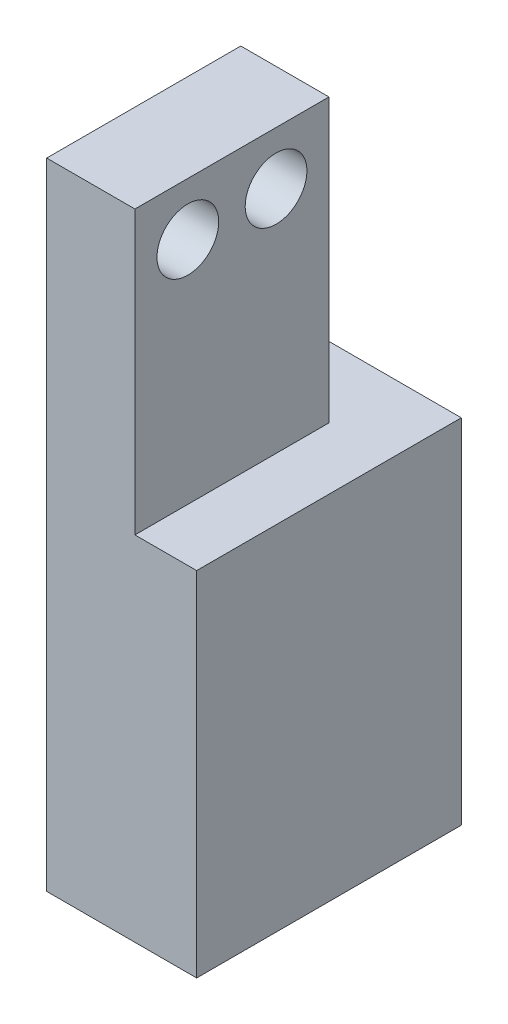
ISO-10303-21;
HEADER;
FILE_DESCRIPTION(('STEP AP214'),'2;1');
FILE_NAME('part.step','',(''),(''),'','','');
FILE_SCHEMA(('AUTOMOTIVE_DESIGN { 1 0 10303 214 1 1 1 1 }'));
ENDSEC;
DATA;
#1=APPLICATION_CONTEXT('core data for automotive mechanical design processes');
#2=APPLICATION_PROTOCOL_DEFINITION('international standard','automotive_design',2000,#1);
#3=PRODUCT_CONTEXT('',#1,'mechanical');
#4=PRODUCT('Part','Part','',(#3));
#5=PRODUCT_RELATED_PRODUCT_CATEGORY('part','',(#4));
#6=PRODUCT_DEFINITION_FORMATION('','',#4);
#7=PRODUCT_DEFINITION_CONTEXT('part definition',#1,'design');
#8=PRODUCT_DEFINITION('design','',#6,#7);
#9=PRODUCT_DEFINITION_SHAPE('','',#8);
#10=(LENGTH_UNIT() NAMED_UNIT(*) SI_UNIT(.MILLI.,.METRE.));
#11=(NAMED_UNIT(*) PLANE_ANGLE_UNIT() SI_UNIT($,.RADIAN.));
#12=(NAMED_UNIT(*) SI_UNIT($,.STERADIAN.) SOLID_ANGLE_UNIT());
#13=UNCERTAINTY_MEASURE_WITH_UNIT(LENGTH_MEASURE(1.E-05),#10,'distance_accuracy_value','');
#14=(GEOMETRIC_REPRESENTATION_CONTEXT(3) GLOBAL_UNCERTAINTY_ASSIGNED_CONTEXT((#13)) GLOBAL_UNIT_ASSIGNED_CONTEXT((#10,
#11,#12)) REPRESENTATION_CONTEXT('',''));
#15=CARTESIAN_POINT('',(0.,0.,0.));
#16=DIRECTION('',(0.,0.,1.));
#17=DIRECTION('',(1.,0.,0.));
#18=AXIS2_PLACEMENT_3D('',#15,#16,#17);
#19=CARTESIAN_POINT('',(0.,0.,-15.));
#20=DIRECTION('',(0.,0.,1.));
#21=DIRECTION('',(1.,0.,0.));
#22=AXIS2_PLACEMENT_3D('',#19,#20,#21);
#23=PLANE('',#22);
#24=DIRECTION('',(0.,-1.,0.));
#25=VECTOR('',#24,1.);
#26=CARTESIAN_POINT('',(0.,36.,-15.));
#27=LINE('',#26,#25);
#28=CARTESIAN_POINT('',(0.,20.,-15.));
#29=VERTEX_POINT('',#28);
#30=CARTESIAN_POINT('',(0.,0.,-15.));
#31=VERTEX_POINT('',#30);
#32=EDGE_CURVE('E86',#29,#31,#27,.T.);
#33=ORIENTED_EDGE('',*,*,#32,.F.);
#34=DIRECTION('',(-1.,0.,0.));
#35=VECTOR('',#34,1.);
#36=CARTESIAN_POINT('',(8.5,20.,-15.));
#37=LINE('',#36,#35);
#38=CARTESIAN_POINT('',(8.5,20.,-15.));
#39=VERTEX_POINT('',#38);
#40=EDGE_CURVE('E121',#39,#29,#37,.T.);
#41=ORIENTED_EDGE('',*,*,#40,.F.);
#42=DIRECTION('',(0.,1.,0.));
#43=VECTOR('',#42,1.);
#44=CARTESIAN_POINT('',(8.5,0.,-15.));
#45=LINE('',#44,#43);
#46=CARTESIAN_POINT('',(8.5,0.,-15.));
#47=VERTEX_POINT('',#46);
#48=EDGE_CURVE('E123',#47,#39,#45,.T.);
#49=ORIENTED_EDGE('',*,*,#48,.F.);
#50=DIRECTION('',(1.,0.,0.));
#51=VECTOR('',#50,1.);
#52=CARTESIAN_POINT('',(0.,0.,-15.));
#53=LINE('',#52,#51);
#54=EDGE_CURVE('E126',#31,#47,#53,.T.);
#55=ORIENTED_EDGE('',*,*,#54,.F.);
#56=EDGE_LOOP('',(#33,#41,#49,#55));
#57=FACE_BOUND('',#56,.T.);
#58=ADVANCED_FACE('F35',(#57),#23,.F.);
#59=CARTESIAN_POINT('',(5.,36.,-15.));
#60=DIRECTION('',(0.,1.,0.));
#61=DIRECTION('',(0.,0.,1.));
#62=AXIS2_PLACEMENT_3D('',#59,#60,#61);
#63=PLANE('',#62);
#64=DIRECTION('',(1.,0.,0.));
#65=VECTOR('',#64,1.);
#66=CARTESIAN_POINT('',(0.,36.,-11.));
#67=LINE('',#66,#65);
#68=CARTESIAN_POINT('',(0.,36.,-11.));
#69=VERTEX_POINT('',#68);
#70=CARTESIAN_POINT('',(5.,36.,-11.));
#71=VERTEX_POINT('',#70);
#72=EDGE_CURVE('E106',#69,#71,#67,.T.);
#73=ORIENTED_EDGE('',*,*,#72,.F.);
#74=DIRECTION('',(0.,0.,1.));
#75=VECTOR('',#74,1.);
#76=CARTESIAN_POINT('',(0.,36.,-15.));
#77=LINE('',#76,#75);
#78=CARTESIAN_POINT('',(0.,36.,0.));
#79=VERTEX_POINT('',#78);
#80=EDGE_CURVE('E39',#69,#79,#77,.T.);
#81=ORIENTED_EDGE('',*,*,#80,.T.);
#82=DIRECTION('',(-1.,0.,0.));
#83=VECTOR('',#82,1.);
#84=CARTESIAN_POINT('',(5.,36.,0.));
#85=LINE('',#84,#83);
#86=CARTESIAN_POINT('',(5.,36.,0.));
#87=VERTEX_POINT('',#86);
#88=EDGE_CURVE('E130',#87,#79,#85,.T.);
#89=ORIENTED_EDGE('',*,*,#88,.F.);
#90=DIRECTION('',(0.,0.,1.));
#91=VECTOR('',#90,1.);
#92=CARTESIAN_POINT('',(5.,36.,-15.));
#93=LINE('',#92,#91);
#94=EDGE_CURVE('E11',#71,#87,#93,.T.);
#95=ORIENTED_EDGE('',*,*,#94,.F.);
#96=EDGE_LOOP('',(#73,#81,#89,#95));
#97=FACE_BOUND('',#96,.T.);
#98=ADVANCED_FACE('F37',(#97),#63,.T.);
#99=CARTESIAN_POINT('',(5.,20.,-15.));
#100=DIRECTION('',(1.,0.,0.));
#101=DIRECTION('',(0.,1.,0.));
#102=AXIS2_PLACEMENT_3D('',#99,#100,#101);
#103=PLANE('',#102);
#104=CARTESIAN_POINT('',(5.,33.,-3.));
#105=DIRECTION('',(1.,0.,0.));
#106=DIRECTION('',(0.,1.,0.));
#107=AXIS2_PLACEMENT_3D('',#104,#105,#106);
#108=CIRCLE('',#107,1.75);
#109=CARTESIAN_POINT('',(5.,34.75,-3.));
#110=VERTEX_POINT('',#109);
#111=EDGE_CURVE('E170',#110,#110,#108,.T.);
#112=ORIENTED_EDGE('',*,*,#111,.F.);
#113=EDGE_LOOP('',(#112));
#114=FACE_BOUND('',#113,.T.);
#115=CARTESIAN_POINT('',(5.,33.,-8.));
#116=DIRECTION('',(1.,0.,0.));
#117=DIRECTION('',(0.,1.,0.));
#118=AXIS2_PLACEMENT_3D('',#115,#116,#117);
#119=CIRCLE('',#118,1.75);
#120=CARTESIAN_POINT('',(5.,34.75,-8.));
#121=VERTEX_POINT('',#120);
#122=EDGE_CURVE('E164',#121,#121,#119,.T.);
#123=ORIENTED_EDGE('',*,*,#122,.F.);
#124=EDGE_LOOP('',(#123));
#125=FACE_BOUND('',#124,.T.);
#126=DIRECTION('',(0.,1.,0.));
#127=VECTOR('',#126,1.);
#128=CARTESIAN_POINT('',(5.,13.5968757625671,-11.));
#129=LINE('',#128,#127);
#130=CARTESIAN_POINT('',(5.,20.,-11.));
#131=VERTEX_POINT('',#130);
#132=EDGE_CURVE('E110',#131,#71,#129,.T.);
#133=ORIENTED_EDGE('',*,*,#132,.T.);
#134=ORIENTED_EDGE('',*,*,#94,.T.);
#135=DIRECTION('',(0.,1.,0.));
#136=VECTOR('',#135,1.);
#137=CARTESIAN_POINT('',(5.,20.,0.));
#138=LINE('',#137,#136);
#139=CARTESIAN_POINT('',(5.,20.,0.));
#140=VERTEX_POINT('',#139);
#141=EDGE_CURVE('E141',#140,#87,#138,.T.);
#142=ORIENTED_EDGE('',*,*,#141,.F.);
#143=DIRECTION('',(0.,0.,1.));
#144=VECTOR('',#143,1.);
#145=CARTESIAN_POINT('',(5.,20.,-15.));
#146=LINE('',#145,#144);
#147=EDGE_CURVE('E45',#131,#140,#146,.T.);
#148=ORIENTED_EDGE('',*,*,#147,.F.);
#149=EDGE_LOOP('',(#133,#134,#142,#148));
#150=FACE_BOUND('',#149,.T.);
#151=ADVANCED_FACE('F157',(#114,#125,#150),#103,.T.);
#152=CARTESIAN_POINT('',(8.5,20.,-15.));
#153=DIRECTION('',(0.,1.,0.));
#154=DIRECTION('',(0.,0.,1.));
#155=AXIS2_PLACEMENT_3D('',#152,#153,#154);
#156=PLANE('',#155);
#157=DIRECTION('',(-1.,0.,0.));
#158=VECTOR('',#157,1.);
#159=CARTESIAN_POINT('',(8.5,20.,0.));
#160=LINE('',#159,#158);
#161=CARTESIAN_POINT('',(8.5,20.,0.));
#162=VERTEX_POINT('',#161);
#163=EDGE_CURVE('E139',#162,#140,#160,.T.);
#164=ORIENTED_EDGE('',*,*,#163,.F.);
#165=DIRECTION('',(0.,0.,1.));
#166=VECTOR('',#165,1.);
#167=CARTESIAN_POINT('',(8.5,20.,-15.));
#168=LINE('',#167,#166);
#169=EDGE_CURVE('E54',#39,#162,#168,.T.);
#170=ORIENTED_EDGE('',*,*,#169,.F.);
#171=ORIENTED_EDGE('',*,*,#40,.T.);
#172=DIRECTION('',(0.,0.,-1.));
#173=VECTOR('',#172,1.);
#174=CARTESIAN_POINT('',(0.,20.,-15.));
#175=LINE('',#174,#173);
#176=CARTESIAN_POINT('',(0.,20.,-11.));
#177=VERTEX_POINT('',#176);
#178=EDGE_CURVE('E158',#177,#29,#175,.T.);
#179=ORIENTED_EDGE('',*,*,#178,.F.);
#180=DIRECTION('',(-1.,0.,0.));
#181=VECTOR('',#180,1.);
#182=CARTESIAN_POINT('',(0.,20.,-11.));
#183=LINE('',#182,#181);
#184=EDGE_CURVE('E107',#131,#177,#183,.T.);
#185=ORIENTED_EDGE('',*,*,#184,.F.);
#186=ORIENTED_EDGE('',*,*,#147,.T.);
#187=EDGE_LOOP('',(#164,#170,#171,#179,#185,#186));
#188=FACE_BOUND('',#187,.T.);
#189=ADVANCED_FACE('F187',(#188),#156,.T.);
#190=CARTESIAN_POINT('',(8.5,0.,-15.));
#191=DIRECTION('',(1.,0.,0.));
#192=DIRECTION('',(0.,0.,-1.));
#193=AXIS2_PLACEMENT_3D('',#190,#191,#192);
#194=PLANE('',#193);
#195=DIRECTION('',(0.,1.,0.));
#196=VECTOR('',#195,1.);
#197=CARTESIAN_POINT('',(8.5,0.,0.));
#198=LINE('',#197,#196);
#199=CARTESIAN_POINT('',(8.5,0.,0.));
#200=VERTEX_POINT('',#199);
#201=EDGE_CURVE('E136',#200,#162,#198,.T.);
#202=ORIENTED_EDGE('',*,*,#201,.F.);
#203=DIRECTION('',(0.,0.,1.));
#204=VECTOR('',#203,1.);
#205=CARTESIAN_POINT('',(8.5,0.,-15.));
#206=LINE('',#205,#204);
#207=EDGE_CURVE('E122',#47,#200,#206,.T.);
#208=ORIENTED_EDGE('',*,*,#207,.F.);
#209=ORIENTED_EDGE('',*,*,#48,.T.);
#210=ORIENTED_EDGE('',*,*,#169,.T.);
#211=EDGE_LOOP('',(#202,#208,#209,#210));
#212=FACE_BOUND('',#211,.T.);
#213=ADVANCED_FACE('F154',(#212),#194,.T.);
#214=CARTESIAN_POINT('',(0.,0.,-15.));
#215=DIRECTION('',(0.,-1.,0.));
#216=DIRECTION('',(0.,0.,-1.));
#217=AXIS2_PLACEMENT_3D('',#214,#215,#216);
#218=PLANE('',#217);
#219=DIRECTION('',(1.,0.,0.));
#220=VECTOR('',#219,1.);
#221=CARTESIAN_POINT('',(0.,0.,0.));
#222=LINE('',#221,#220);
#223=CARTESIAN_POINT('',(0.,0.,0.));
#224=VERTEX_POINT('',#223);
#225=EDGE_CURVE('E133',#224,#200,#222,.T.);
#226=ORIENTED_EDGE('',*,*,#225,.F.);
#227=DIRECTION('',(0.,0.,1.));
#228=VECTOR('',#227,1.);
#229=CARTESIAN_POINT('',(0.,0.,-15.));
#230=LINE('',#229,#228);
#231=EDGE_CURVE('E120',#31,#224,#230,.T.);
#232=ORIENTED_EDGE('',*,*,#231,.F.);
#233=ORIENTED_EDGE('',*,*,#54,.T.);
#234=ORIENTED_EDGE('',*,*,#207,.T.);
#235=EDGE_LOOP('',(#226,#232,#233,#234));
#236=FACE_BOUND('',#235,.T.);
#237=ADVANCED_FACE('F150',(#236),#218,.T.);
#238=CARTESIAN_POINT('',(0.,36.,-15.));
#239=DIRECTION('',(-1.,0.,0.));
#240=DIRECTION('',(0.,-1.,0.));
#241=AXIS2_PLACEMENT_3D('',#238,#239,#240);
#242=PLANE('',#241);
#243=CARTESIAN_POINT('',(0.,33.,-3.));
#244=DIRECTION('',(1.,0.,0.));
#245=DIRECTION('',(0.,1.,0.));
#246=AXIS2_PLACEMENT_3D('',#243,#244,#245);
#247=CIRCLE('',#246,1.75);
#248=CARTESIAN_POINT('',(0.,34.75,-3.));
#249=VERTEX_POINT('',#248);
#250=EDGE_CURVE('E114',#249,#249,#247,.T.);
#251=ORIENTED_EDGE('',*,*,#250,.T.);
#252=EDGE_LOOP('',(#251));
#253=FACE_BOUND('',#252,.T.);
#254=CARTESIAN_POINT('',(0.,33.,-8.));
#255=DIRECTION('',(1.,0.,0.));
#256=DIRECTION('',(0.,1.,0.));
#257=AXIS2_PLACEMENT_3D('',#254,#255,#256);
#258=CIRCLE('',#257,1.75);
#259=CARTESIAN_POINT('',(0.,34.75,-8.));
#260=VERTEX_POINT('',#259);
#261=EDGE_CURVE('E167',#260,#260,#258,.T.);
#262=ORIENTED_EDGE('',*,*,#261,.T.);
#263=EDGE_LOOP('',(#262));
#264=FACE_BOUND('',#263,.T.);
#265=DIRECTION('',(0.,1.,0.));
#266=VECTOR('',#265,1.);
#267=CARTESIAN_POINT('',(0.,13.5968757625671,-11.));
#268=LINE('',#267,#266);
#269=EDGE_CURVE('E103',#177,#69,#268,.T.);
#270=ORIENTED_EDGE('',*,*,#269,.F.);
#271=ORIENTED_EDGE('',*,*,#178,.T.);
#272=ORIENTED_EDGE('',*,*,#32,.T.);
#273=ORIENTED_EDGE('',*,*,#231,.T.);
#274=DIRECTION('',(0.,-1.,0.));
#275=VECTOR('',#274,1.);
#276=CARTESIAN_POINT('',(0.,36.,0.));
#277=LINE('',#276,#275);
#278=EDGE_CURVE('E118',#79,#224,#277,.T.);
#279=ORIENTED_EDGE('',*,*,#278,.F.);
#280=ORIENTED_EDGE('',*,*,#80,.F.);
#281=EDGE_LOOP('',(#270,#271,#272,#273,#279,#280));
#282=FACE_BOUND('',#281,.T.);
#283=ADVANCED_FACE('F116',(#253,#264,#282),#242,.T.);
#284=CARTESIAN_POINT('',(0.,0.,0.));
#285=DIRECTION('',(0.,0.,1.));
#286=DIRECTION('',(1.,0.,0.));
#287=AXIS2_PLACEMENT_3D('',#284,#285,#286);
#288=PLANE('',#287);
#289=ORIENTED_EDGE('',*,*,#88,.T.);
#290=ORIENTED_EDGE('',*,*,#278,.T.);
#291=ORIENTED_EDGE('',*,*,#225,.T.);
#292=ORIENTED_EDGE('',*,*,#201,.T.);
#293=ORIENTED_EDGE('',*,*,#163,.T.);
#294=ORIENTED_EDGE('',*,*,#141,.T.);
#295=EDGE_LOOP('',(#289,#290,#291,#292,#293,#294));
#296=FACE_BOUND('',#295,.T.);
#297=ADVANCED_FACE('F156',(#296),#288,.T.);
#298=CARTESIAN_POINT('',(0.,13.5968757625671,-11.));
#299=DIRECTION('',(0.,0.,1.));
#300=DIRECTION('',(1.,0.,0.));
#301=AXIS2_PLACEMENT_3D('',#298,#299,#300);
#302=PLANE('',#301);
#303=ORIENTED_EDGE('',*,*,#184,.T.);
#304=ORIENTED_EDGE('',*,*,#269,.T.);
#305=ORIENTED_EDGE('',*,*,#72,.T.);
#306=ORIENTED_EDGE('',*,*,#132,.F.);
#307=EDGE_LOOP('',(#303,#304,#305,#306));
#308=FACE_BOUND('',#307,.T.);
#309=ADVANCED_FACE('F105',(#308),#302,.F.);
#310=CARTESIAN_POINT('',(0.,33.,-8.));
#311=DIRECTION('',(1.,0.,0.));
#312=DIRECTION('',(0.,1.,0.));
#313=AXIS2_PLACEMENT_3D('',#310,#311,#312);
#314=CYLINDRICAL_SURFACE('',#313,1.75);
#315=ORIENTED_EDGE('',*,*,#261,.F.);
#316=EDGE_LOOP('',(#315));
#317=FACE_BOUND('',#316,.T.);
#318=ORIENTED_EDGE('',*,*,#122,.T.);
#319=EDGE_LOOP('',(#318));
#320=FACE_BOUND('',#319,.T.);
#321=ADVANCED_FACE('F181',(#317,#320),#314,.F.);
#322=CARTESIAN_POINT('',(0.,33.,-3.));
#323=DIRECTION('',(1.,0.,0.));
#324=DIRECTION('',(0.,1.,0.));
#325=AXIS2_PLACEMENT_3D('',#322,#323,#324);
#326=CYLINDRICAL_SURFACE('',#325,1.75);
#327=ORIENTED_EDGE('',*,*,#250,.F.);
#328=EDGE_LOOP('',(#327));
#329=FACE_BOUND('',#328,.T.);
#330=ORIENTED_EDGE('',*,*,#111,.T.);
#331=EDGE_LOOP('',(#330));
#332=FACE_BOUND('',#331,.T.);
#333=ADVANCED_FACE('F178',(#329,#332),#326,.F.);
#334=CLOSED_SHELL('',(#58,#98,#151,#189,#213,#237,#283,#297,#309,#321,#333));
#335=MANIFOLD_SOLID_BREP('B2',#334);
#336=ADVANCED_BREP_SHAPE_REPRESENTATION('',(#18,#335),#14);
#337=SHAPE_DEFINITION_REPRESENTATION(#9,#336);
ENDSEC;
END-ISO-10303-21;
